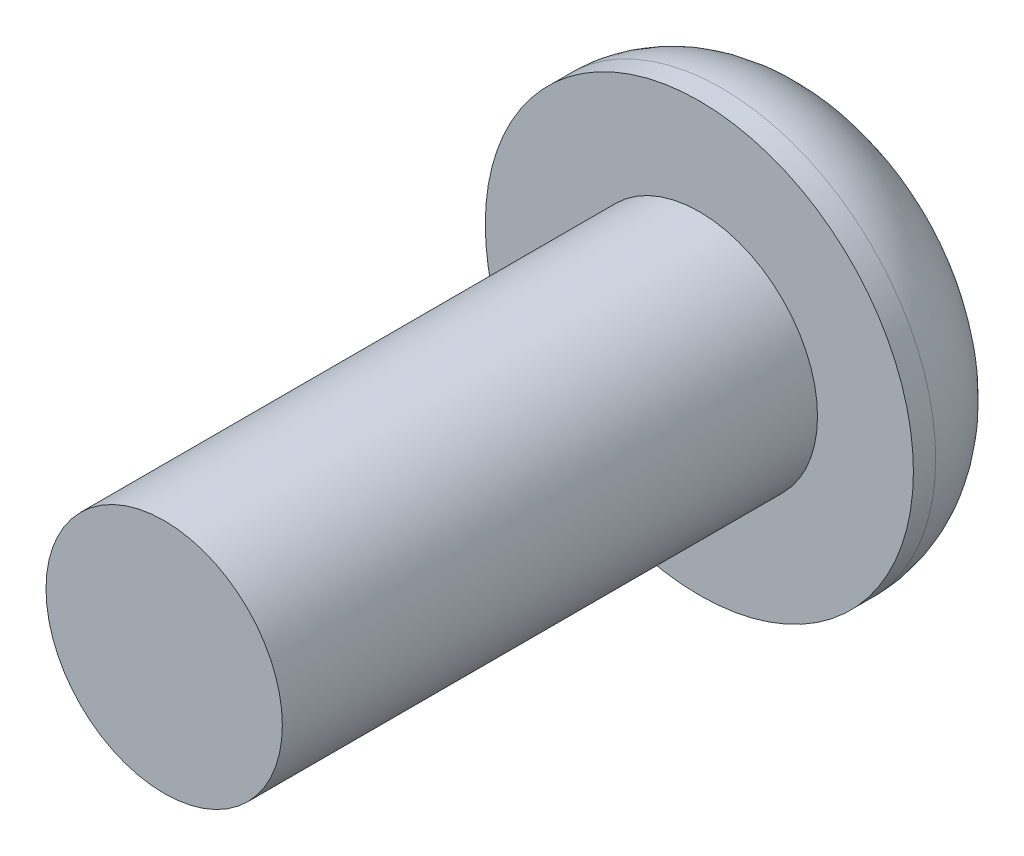
ISO-10303-21;
HEADER;
FILE_DESCRIPTION(('STEP AP214'),'2;1');
FILE_NAME('part.step','',(''),(''),'','','');
FILE_SCHEMA(('AUTOMOTIVE_DESIGN { 1 0 10303 214 1 1 1 1 }'));
ENDSEC;
DATA;
#1=APPLICATION_CONTEXT('core data for automotive mechanical design processes');
#2=APPLICATION_PROTOCOL_DEFINITION('international standard','automotive_design',2000,#1);
#3=PRODUCT_CONTEXT('',#1,'mechanical');
#4=PRODUCT('Part','Part','',(#3));
#5=PRODUCT_RELATED_PRODUCT_CATEGORY('part','',(#4));
#6=PRODUCT_DEFINITION_FORMATION('','',#4);
#7=PRODUCT_DEFINITION_CONTEXT('part definition',#1,'design');
#8=PRODUCT_DEFINITION('design','',#6,#7);
#9=PRODUCT_DEFINITION_SHAPE('','',#8);
#10=(LENGTH_UNIT() NAMED_UNIT(*) SI_UNIT(.MILLI.,.METRE.));
#11=(NAMED_UNIT(*) PLANE_ANGLE_UNIT() SI_UNIT($,.RADIAN.));
#12=(NAMED_UNIT(*) SI_UNIT($,.STERADIAN.) SOLID_ANGLE_UNIT());
#13=UNCERTAINTY_MEASURE_WITH_UNIT(LENGTH_MEASURE(1.E-05),#10,'distance_accuracy_value','');
#14=(GEOMETRIC_REPRESENTATION_CONTEXT(3) GLOBAL_UNCERTAINTY_ASSIGNED_CONTEXT((#13)) GLOBAL_UNIT_ASSIGNED_CONTEXT((#10,
#11,#12)) REPRESENTATION_CONTEXT('',''));
#15=CARTESIAN_POINT('',(0.,0.,0.));
#16=DIRECTION('',(0.,0.,1.));
#17=DIRECTION('',(1.,0.,0.));
#18=AXIS2_PLACEMENT_3D('',#15,#16,#17);
#19=CARTESIAN_POINT('',(0.,0.,1.8542));
#20=DIRECTION('',(0.,0.,1.));
#21=DIRECTION('',(1.,0.,0.));
#22=AXIS2_PLACEMENT_3D('',#19,#20,#21);
#23=PLANE('',#22);
#24=CARTESIAN_POINT('',(0.,0.,1.8542));
#25=DIRECTION('',(0.,0.,1.));
#26=DIRECTION('',(1.,0.,0.));
#27=AXIS2_PLACEMENT_3D('',#24,#25,#26);
#28=CIRCLE('',#27,3.175);
#29=CARTESIAN_POINT('',(3.175,0.,1.8542));
#30=VERTEX_POINT('',#29);
#31=EDGE_CURVE('E142',#30,#30,#28,.T.);
#32=ORIENTED_EDGE('',*,*,#31,.T.);
#33=EDGE_LOOP('',(#32));
#34=FACE_BOUND('',#33,.T.);
#35=CARTESIAN_POINT('',(0.,0.,1.8542));
#36=DIRECTION('',(0.,0.,1.));
#37=DIRECTION('',(1.,0.,0.));
#38=AXIS2_PLACEMENT_3D('',#35,#36,#37);
#39=CIRCLE('',#38,1.7526);
#40=CARTESIAN_POINT('',(1.7526,0.,1.8542));
#41=VERTEX_POINT('',#40);
#42=EDGE_CURVE('E133',#41,#41,#39,.T.);
#43=ORIENTED_EDGE('',*,*,#42,.F.);
#44=EDGE_LOOP('',(#43));
#45=FACE_BOUND('',#44,.T.);
#46=ADVANCED_FACE('F31',(#34,#45),#23,.T.);
#47=CARTESIAN_POINT('',(0.,0.,1.8542));
#48=DIRECTION('',(0.,0.,-1.));
#49=DIRECTION('',(-1.,0.,0.));
#50=AXIS2_PLACEMENT_3D('',#47,#48,#49);
#51=CYLINDRICAL_SURFACE('',#50,3.175);
#52=CARTESIAN_POINT('',(0.,0.,1.524));
#53=DIRECTION('',(0.,0.,1.));
#54=DIRECTION('',(1.,0.,0.));
#55=AXIS2_PLACEMENT_3D('',#52,#53,#54);
#56=CIRCLE('',#55,3.175);
#57=CARTESIAN_POINT('',(3.175,0.,1.524));
#58=VERTEX_POINT('',#57);
#59=EDGE_CURVE('E39',#58,#58,#56,.T.);
#60=ORIENTED_EDGE('',*,*,#59,.T.);
#61=EDGE_LOOP('',(#60));
#62=FACE_BOUND('',#61,.T.);
#63=ORIENTED_EDGE('',*,*,#31,.F.);
#64=EDGE_LOOP('',(#63));
#65=FACE_BOUND('',#64,.T.);
#66=ADVANCED_FACE('F149',(#62,#65),#51,.T.);
#67=CARTESIAN_POINT('',(0.,0.,0.));
#68=DIRECTION('',(0.,0.,1.));
#69=DIRECTION('',(1.,0.,0.));
#70=AXIS2_PLACEMENT_3D('',#67,#68,#69);
#71=PLANE('',#70);
#72=DIRECTION('',(0.999833415798117,0.0182521410653724,0.));
#73=VECTOR('',#72,1.);
#74=CARTESIAN_POINT('',(-0.590853840377281,0.981566665856041,0.));
#75=LINE('',#74,#73);
#76=CARTESIAN_POINT('',(-0.590853840377281,0.981566665856041,0.));
#77=VERTEX_POINT('',#76);
#78=CARTESIAN_POINT('',(0.554634747950682,1.00247776861834,0.));
#79=VERTEX_POINT('',#78);
#80=EDGE_CURVE('E120',#77,#79,#75,.T.);
#81=ORIENTED_EDGE('',*,*,#80,.F.);
#82=DIRECTION('',(0.484109890062989,0.875007208166425,0.));
#83=VECTOR('',#82,1.);
#84=CARTESIAN_POINT('',(-1.14548858832796,-0.020911102762301,0.));
#85=LINE('',#84,#83);
#86=CARTESIAN_POINT('',(-1.14548858832796,-0.020911102762301,0.));
#87=VERTEX_POINT('',#86);
#88=EDGE_CURVE('E46',#87,#77,#85,.T.);
#89=ORIENTED_EDGE('',*,*,#88,.F.);
#90=DIRECTION('',(-0.515723525735128,0.856755067101052,0.));
#91=VECTOR('',#90,1.);
#92=CARTESIAN_POINT('',(-0.554634747950683,-1.00247776861834,0.));
#93=LINE('',#92,#91);
#94=CARTESIAN_POINT('',(-0.554634747950683,-1.00247776861834,0.));
#95=VERTEX_POINT('',#94);
#96=EDGE_CURVE('E129',#95,#87,#93,.T.);
#97=ORIENTED_EDGE('',*,*,#96,.F.);
#98=DIRECTION('',(-0.999833415798117,-0.0182521410653724,0.));
#99=VECTOR('',#98,1.);
#100=CARTESIAN_POINT('',(0.59085384037728,-0.981566665856041,0.));
#101=LINE('',#100,#99);
#102=CARTESIAN_POINT('',(0.59085384037728,-0.981566665856041,0.));
#103=VERTEX_POINT('',#102);
#104=EDGE_CURVE('E127',#103,#95,#101,.T.);
#105=ORIENTED_EDGE('',*,*,#104,.F.);
#106=DIRECTION('',(-0.484109890062989,-0.875007208166425,0.));
#107=VECTOR('',#106,1.);
#108=CARTESIAN_POINT('',(1.14548858832796,0.0209111027623002,0.));
#109=LINE('',#108,#107);
#110=CARTESIAN_POINT('',(1.14548858832796,0.0209111027623002,0.));
#111=VERTEX_POINT('',#110);
#112=EDGE_CURVE('E94',#111,#103,#109,.T.);
#113=ORIENTED_EDGE('',*,*,#112,.F.);
#114=DIRECTION('',(0.515723525735128,-0.856755067101053,0.));
#115=VECTOR('',#114,1.);
#116=CARTESIAN_POINT('',(0.554634747950682,1.00247776861834,0.));
#117=LINE('',#116,#115);
#118=EDGE_CURVE('E123',#79,#111,#117,.T.);
#119=ORIENTED_EDGE('',*,*,#118,.F.);
#120=EDGE_LOOP('',(#81,#89,#97,#105,#113,#119));
#121=FACE_BOUND('',#120,.T.);
#122=CARTESIAN_POINT('',(0.,0.,0.));
#123=DIRECTION('',(0.,0.,1.));
#124=DIRECTION('',(1.,0.,0.));
#125=AXIS2_PLACEMENT_3D('',#122,#123,#124);
#126=CIRCLE('',#125,1.651);
#127=CARTESIAN_POINT('',(1.651,0.,0.));
#128=VERTEX_POINT('',#127);
#129=EDGE_CURVE('E11',#128,#128,#126,.F.);
#130=ORIENTED_EDGE('',*,*,#129,.T.);
#131=EDGE_LOOP('',(#130));
#132=FACE_BOUND('',#131,.T.);
#133=ADVANCED_FACE('F154',(#121,#132),#71,.F.);
#134=CARTESIAN_POINT('',(0.,0.,1.524));
#135=DIRECTION('',(0.,0.,1.));
#136=DIRECTION('',(1.,0.,0.));
#137=AXIS2_PLACEMENT_3D('',#134,#135,#136);
#138=TOROIDAL_SURFACE('',#137,1.651,1.524);
#139=ORIENTED_EDGE('',*,*,#129,.F.);
#140=EDGE_LOOP('',(#139));
#141=FACE_BOUND('',#140,.T.);
#142=ORIENTED_EDGE('',*,*,#59,.F.);
#143=EDGE_LOOP('',(#142));
#144=FACE_BOUND('',#143,.T.);
#145=ADVANCED_FACE('F33',(#141,#144),#138,.T.);
#146=CARTESIAN_POINT('',(0.,0.,9.7917));
#147=DIRECTION('',(0.,0.,-1.));
#148=DIRECTION('',(-1.,0.,0.));
#149=AXIS2_PLACEMENT_3D('',#146,#147,#148);
#150=CYLINDRICAL_SURFACE('',#149,1.7526);
#151=CARTESIAN_POINT('',(0.,0.,9.7917));
#152=DIRECTION('',(0.,0.,1.));
#153=DIRECTION('',(1.,0.,0.));
#154=AXIS2_PLACEMENT_3D('',#151,#152,#153);
#155=CIRCLE('',#154,1.7526);
#156=CARTESIAN_POINT('',(1.7526,0.,9.7917));
#157=VERTEX_POINT('',#156);
#158=EDGE_CURVE('E139',#157,#157,#155,.T.);
#159=ORIENTED_EDGE('',*,*,#158,.F.);
#160=EDGE_LOOP('',(#159));
#161=FACE_BOUND('',#160,.T.);
#162=ORIENTED_EDGE('',*,*,#42,.T.);
#163=EDGE_LOOP('',(#162));
#164=FACE_BOUND('',#163,.T.);
#165=ADVANCED_FACE('F153',(#161,#164),#150,.T.);
#166=CARTESIAN_POINT('',(0.,0.,9.7917));
#167=DIRECTION('',(0.,0.,1.));
#168=DIRECTION('',(1.,0.,0.));
#169=AXIS2_PLACEMENT_3D('',#166,#167,#168);
#170=PLANE('',#169);
#171=ORIENTED_EDGE('',*,*,#158,.T.);
#172=EDGE_LOOP('',(#171));
#173=FACE_BOUND('',#172,.T.);
#174=ADVANCED_FACE('F160',(#173),#170,.T.);
#175=CARTESIAN_POINT('',(-1.14548858832796,-0.020911102762301,1.016));
#176=DIRECTION('',(-0.875007208166425,0.484109890062989,0.));
#177=DIRECTION('',(-0.484109890062989,-0.875007208166425,0.));
#178=AXIS2_PLACEMENT_3D('',#175,#176,#177);
#179=PLANE('',#178);
#180=ORIENTED_EDGE('',*,*,#88,.T.);
#181=DIRECTION('',(0.,0.,-1.));
#182=VECTOR('',#181,1.);
#183=CARTESIAN_POINT('',(-0.590853840377281,0.981566665856041,1.016));
#184=LINE('',#183,#182);
#185=CARTESIAN_POINT('',(-0.590853840377281,0.981566665856041,1.016));
#186=VERTEX_POINT('',#185);
#187=EDGE_CURVE('E76',#186,#77,#184,.T.);
#188=ORIENTED_EDGE('',*,*,#187,.F.);
#189=DIRECTION('',(0.484109890062989,0.875007208166425,0.));
#190=VECTOR('',#189,1.);
#191=CARTESIAN_POINT('',(-1.14548858832796,-0.020911102762301,1.016));
#192=LINE('',#191,#190);
#193=CARTESIAN_POINT('',(-1.14548858832796,-0.020911102762301,1.016));
#194=VERTEX_POINT('',#193);
#195=EDGE_CURVE('E131',#194,#186,#192,.T.);
#196=ORIENTED_EDGE('',*,*,#195,.F.);
#197=DIRECTION('',(0.,0.,-1.));
#198=VECTOR('',#197,1.);
#199=CARTESIAN_POINT('',(-1.14548858832796,-0.020911102762301,1.016));
#200=LINE('',#199,#198);
#201=EDGE_CURVE('E54',#194,#87,#200,.T.);
#202=ORIENTED_EDGE('',*,*,#201,.T.);
#203=EDGE_LOOP('',(#180,#188,#196,#202));
#204=FACE_BOUND('',#203,.T.);
#205=ADVANCED_FACE('F176',(#204),#179,.F.);
#206=CARTESIAN_POINT('',(-0.554634747950683,-1.00247776861834,1.016));
#207=DIRECTION('',(-0.856755067101052,-0.515723525735128,0.));
#208=DIRECTION('',(0.515723525735128,-0.856755067101052,0.));
#209=AXIS2_PLACEMENT_3D('',#206,#207,#208);
#210=PLANE('',#209);
#211=ORIENTED_EDGE('',*,*,#96,.T.);
#212=ORIENTED_EDGE('',*,*,#201,.F.);
#213=DIRECTION('',(-0.515723525735128,0.856755067101052,0.));
#214=VECTOR('',#213,1.);
#215=CARTESIAN_POINT('',(-0.554634747950683,-1.00247776861834,1.016));
#216=LINE('',#215,#214);
#217=CARTESIAN_POINT('',(-0.554634747950683,-1.00247776861834,1.016));
#218=VERTEX_POINT('',#217);
#219=EDGE_CURVE('E106',#218,#194,#216,.T.);
#220=ORIENTED_EDGE('',*,*,#219,.F.);
#221=DIRECTION('',(0.,0.,-1.));
#222=VECTOR('',#221,1.);
#223=CARTESIAN_POINT('',(-0.554634747950683,-1.00247776861834,1.016));
#224=LINE('',#223,#222);
#225=EDGE_CURVE('E98',#218,#95,#224,.T.);
#226=ORIENTED_EDGE('',*,*,#225,.T.);
#227=EDGE_LOOP('',(#211,#212,#220,#226));
#228=FACE_BOUND('',#227,.T.);
#229=ADVANCED_FACE('F180',(#228),#210,.F.);
#230=CARTESIAN_POINT('',(0.59085384037728,-0.981566665856041,1.016));
#231=DIRECTION('',(0.0182521410653724,-0.999833415798117,0.));
#232=DIRECTION('',(0.999833415798117,0.0182521410653724,0.));
#233=AXIS2_PLACEMENT_3D('',#230,#231,#232);
#234=PLANE('',#233);
#235=ORIENTED_EDGE('',*,*,#104,.T.);
#236=ORIENTED_EDGE('',*,*,#225,.F.);
#237=DIRECTION('',(-0.999833415798117,-0.0182521410653724,0.));
#238=VECTOR('',#237,1.);
#239=CARTESIAN_POINT('',(0.59085384037728,-0.981566665856041,1.016));
#240=LINE('',#239,#238);
#241=CARTESIAN_POINT('',(0.59085384037728,-0.981566665856041,1.016));
#242=VERTEX_POINT('',#241);
#243=EDGE_CURVE('E102',#242,#218,#240,.T.);
#244=ORIENTED_EDGE('',*,*,#243,.F.);
#245=DIRECTION('',(0.,0.,-1.));
#246=VECTOR('',#245,1.);
#247=CARTESIAN_POINT('',(0.59085384037728,-0.981566665856041,1.016));
#248=LINE('',#247,#246);
#249=EDGE_CURVE('E87',#242,#103,#248,.T.);
#250=ORIENTED_EDGE('',*,*,#249,.T.);
#251=EDGE_LOOP('',(#235,#236,#244,#250));
#252=FACE_BOUND('',#251,.T.);
#253=ADVANCED_FACE('F103',(#252),#234,.F.);
#254=CARTESIAN_POINT('',(1.14548858832796,0.0209111027623002,1.016));
#255=DIRECTION('',(0.875007208166425,-0.484109890062989,0.));
#256=DIRECTION('',(0.484109890062989,0.875007208166425,0.));
#257=AXIS2_PLACEMENT_3D('',#254,#255,#256);
#258=PLANE('',#257);
#259=ORIENTED_EDGE('',*,*,#112,.T.);
#260=ORIENTED_EDGE('',*,*,#249,.F.);
#261=DIRECTION('',(-0.484109890062989,-0.875007208166425,0.));
#262=VECTOR('',#261,1.);
#263=CARTESIAN_POINT('',(1.14548858832796,0.0209111027623002,1.016));
#264=LINE('',#263,#262);
#265=CARTESIAN_POINT('',(1.14548858832796,0.0209111027623002,1.016));
#266=VERTEX_POINT('',#265);
#267=EDGE_CURVE('E91',#266,#242,#264,.T.);
#268=ORIENTED_EDGE('',*,*,#267,.F.);
#269=DIRECTION('',(0.,0.,-1.));
#270=VECTOR('',#269,1.);
#271=CARTESIAN_POINT('',(1.14548858832796,0.0209111027623002,1.016));
#272=LINE('',#271,#270);
#273=EDGE_CURVE('E99',#266,#111,#272,.T.);
#274=ORIENTED_EDGE('',*,*,#273,.T.);
#275=EDGE_LOOP('',(#259,#260,#268,#274));
#276=FACE_BOUND('',#275,.T.);
#277=ADVANCED_FACE('F89',(#276),#258,.F.);
#278=CARTESIAN_POINT('',(0.554634747950682,1.00247776861834,1.016));
#279=DIRECTION('',(0.856755067101053,0.515723525735128,0.));
#280=DIRECTION('',(-0.515723525735128,0.856755067101052,0.));
#281=AXIS2_PLACEMENT_3D('',#278,#279,#280);
#282=PLANE('',#281);
#283=ORIENTED_EDGE('',*,*,#118,.T.);
#284=ORIENTED_EDGE('',*,*,#273,.F.);
#285=DIRECTION('',(0.515723525735128,-0.856755067101053,0.));
#286=VECTOR('',#285,1.);
#287=CARTESIAN_POINT('',(0.554634747950682,1.00247776861834,1.016));
#288=LINE('',#287,#286);
#289=CARTESIAN_POINT('',(0.554634747950682,1.00247776861834,1.016));
#290=VERTEX_POINT('',#289);
#291=EDGE_CURVE('E112',#290,#266,#288,.T.);
#292=ORIENTED_EDGE('',*,*,#291,.F.);
#293=DIRECTION('',(0.,0.,-1.));
#294=VECTOR('',#293,1.);
#295=CARTESIAN_POINT('',(0.554634747950682,1.00247776861834,1.016));
#296=LINE('',#295,#294);
#297=EDGE_CURVE('E136',#290,#79,#296,.T.);
#298=ORIENTED_EDGE('',*,*,#297,.T.);
#299=EDGE_LOOP('',(#283,#284,#292,#298));
#300=FACE_BOUND('',#299,.T.);
#301=ADVANCED_FACE('F184',(#300),#282,.F.);
#302=CARTESIAN_POINT('',(-0.590853840377281,0.981566665856041,1.016));
#303=DIRECTION('',(-0.0182521410653723,0.999833415798117,0.));
#304=DIRECTION('',(-0.999833415798117,-0.0182521410653724,0.));
#305=AXIS2_PLACEMENT_3D('',#302,#303,#304);
#306=PLANE('',#305);
#307=ORIENTED_EDGE('',*,*,#80,.T.);
#308=ORIENTED_EDGE('',*,*,#297,.F.);
#309=DIRECTION('',(0.999833415798117,0.0182521410653724,0.));
#310=VECTOR('',#309,1.);
#311=CARTESIAN_POINT('',(-0.590853840377281,0.981566665856041,1.016));
#312=LINE('',#311,#310);
#313=EDGE_CURVE('E114',#186,#290,#312,.T.);
#314=ORIENTED_EDGE('',*,*,#313,.F.);
#315=ORIENTED_EDGE('',*,*,#187,.T.);
#316=EDGE_LOOP('',(#307,#308,#314,#315));
#317=FACE_BOUND('',#316,.T.);
#318=ADVANCED_FACE('F181',(#317),#306,.F.);
#319=CARTESIAN_POINT('',(-0.590853840377281,0.981566665856041,1.016));
#320=DIRECTION('',(0.,0.,-1.));
#321=DIRECTION('',(-1.,0.,0.));
#322=AXIS2_PLACEMENT_3D('',#319,#320,#321);
#323=PLANE('',#322);
#324=ORIENTED_EDGE('',*,*,#195,.T.);
#325=ORIENTED_EDGE('',*,*,#313,.T.);
#326=ORIENTED_EDGE('',*,*,#291,.T.);
#327=ORIENTED_EDGE('',*,*,#267,.T.);
#328=ORIENTED_EDGE('',*,*,#243,.T.);
#329=ORIENTED_EDGE('',*,*,#219,.T.);
#330=EDGE_LOOP('',(#324,#325,#326,#327,#328,#329));
#331=FACE_BOUND('',#330,.T.);
#332=ADVANCED_FACE('F109',(#331),#323,.T.);
#333=CLOSED_SHELL('',(#46,#66,#133,#145,#165,#174,#205,#229,#253,#277,#301,#318,#332));
#334=MANIFOLD_SOLID_BREP('B2',#333);
#335=ADVANCED_BREP_SHAPE_REPRESENTATION('',(#18,#334),#14);
#336=SHAPE_DEFINITION_REPRESENTATION(#9,#335);
ENDSEC;
END-ISO-10303-21;
